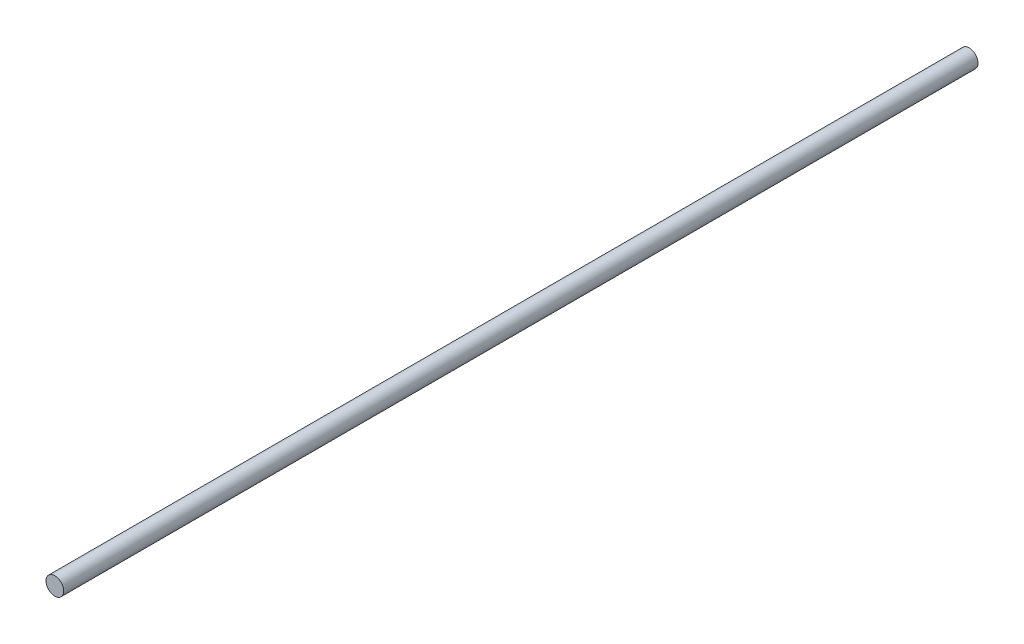
ISO-10303-21;
HEADER;
FILE_DESCRIPTION(('STEP AP214'),'2;1');
FILE_NAME('part.step','',(''),(''),'','','');
FILE_SCHEMA(('AUTOMOTIVE_DESIGN { 1 0 10303 214 1 1 1 1 }'));
ENDSEC;
DATA;
#1=APPLICATION_CONTEXT('core data for automotive mechanical design processes');
#2=APPLICATION_PROTOCOL_DEFINITION('international standard','automotive_design',2000,#1);
#3=PRODUCT_CONTEXT('',#1,'mechanical');
#4=PRODUCT('Part','Part','',(#3));
#5=PRODUCT_RELATED_PRODUCT_CATEGORY('part','',(#4));
#6=PRODUCT_DEFINITION_FORMATION('','',#4);
#7=PRODUCT_DEFINITION_CONTEXT('part definition',#1,'design');
#8=PRODUCT_DEFINITION('design','',#6,#7);
#9=PRODUCT_DEFINITION_SHAPE('','',#8);
#10=(LENGTH_UNIT() NAMED_UNIT(*) SI_UNIT(.MILLI.,.METRE.));
#11=(NAMED_UNIT(*) PLANE_ANGLE_UNIT() SI_UNIT($,.RADIAN.));
#12=(NAMED_UNIT(*) SI_UNIT($,.STERADIAN.) SOLID_ANGLE_UNIT());
#13=UNCERTAINTY_MEASURE_WITH_UNIT(LENGTH_MEASURE(1.E-05),#10,'distance_accuracy_value','');
#14=(GEOMETRIC_REPRESENTATION_CONTEXT(3) GLOBAL_UNCERTAINTY_ASSIGNED_CONTEXT((#13)) GLOBAL_UNIT_ASSIGNED_CONTEXT((#10,
#11,#12)) REPRESENTATION_CONTEXT('',''));
#15=CARTESIAN_POINT('',(0.,0.,0.));
#16=DIRECTION('',(0.,0.,1.));
#17=DIRECTION('',(1.,0.,0.));
#18=AXIS2_PLACEMENT_3D('',#15,#16,#17);
#19=CARTESIAN_POINT('',(0.,0.,1550.));
#20=DIRECTION('',(0.,0.,-1.));
#21=DIRECTION('',(-1.,0.,0.));
#22=AXIS2_PLACEMENT_3D('',#19,#20,#21);
#23=CYLINDRICAL_SURFACE('',#22,15.);
#24=CARTESIAN_POINT('',(0.,0.,1550.));
#25=DIRECTION('',(0.,0.,1.));
#26=DIRECTION('',(1.,0.,0.));
#27=AXIS2_PLACEMENT_3D('',#24,#25,#26);
#28=CIRCLE('',#27,15.);
#29=CARTESIAN_POINT('',(15.,0.,1550.));
#30=VERTEX_POINT('',#29);
#31=EDGE_CURVE('E10',#30,#30,#28,.T.);
#32=ORIENTED_EDGE('',*,*,#31,.F.);
#33=EDGE_LOOP('',(#32));
#34=FACE_BOUND('',#33,.T.);
#35=CARTESIAN_POINT('',(0.,0.,0.));
#36=DIRECTION('',(0.,0.,1.));
#37=DIRECTION('',(1.,0.,0.));
#38=AXIS2_PLACEMENT_3D('',#35,#36,#37);
#39=CIRCLE('',#38,15.);
#40=CARTESIAN_POINT('',(15.,0.,0.));
#41=VERTEX_POINT('',#40);
#42=EDGE_CURVE('E44',#41,#41,#39,.T.);
#43=ORIENTED_EDGE('',*,*,#42,.T.);
#44=EDGE_LOOP('',(#43));
#45=FACE_BOUND('',#44,.T.);
#46=ADVANCED_FACE('F41',(#34,#45),#23,.T.);
#47=CARTESIAN_POINT('',(0.,0.,1550.));
#48=DIRECTION('',(0.,0.,1.));
#49=DIRECTION('',(1.,0.,0.));
#50=AXIS2_PLACEMENT_3D('',#47,#48,#49);
#51=PLANE('',#50);
#52=ORIENTED_EDGE('',*,*,#31,.T.);
#53=EDGE_LOOP('',(#52));
#54=FACE_BOUND('',#53,.T.);
#55=ADVANCED_FACE('F58',(#54),#51,.T.);
#56=CARTESIAN_POINT('',(0.,0.,0.));
#57=DIRECTION('',(0.,0.,1.));
#58=DIRECTION('',(1.,0.,0.));
#59=AXIS2_PLACEMENT_3D('',#56,#57,#58);
#60=PLANE('',#59);
#61=ORIENTED_EDGE('',*,*,#42,.F.);
#62=EDGE_LOOP('',(#61));
#63=FACE_BOUND('',#62,.T.);
#64=ADVANCED_FACE('F56',(#63),#60,.F.);
#65=CLOSED_SHELL('',(#46,#55,#64));
#66=MANIFOLD_SOLID_BREP('B2',#65);
#67=ADVANCED_BREP_SHAPE_REPRESENTATION('',(#18,#66),#14);
#68=SHAPE_DEFINITION_REPRESENTATION(#9,#67);
ENDSEC;
END-ISO-10303-21;
